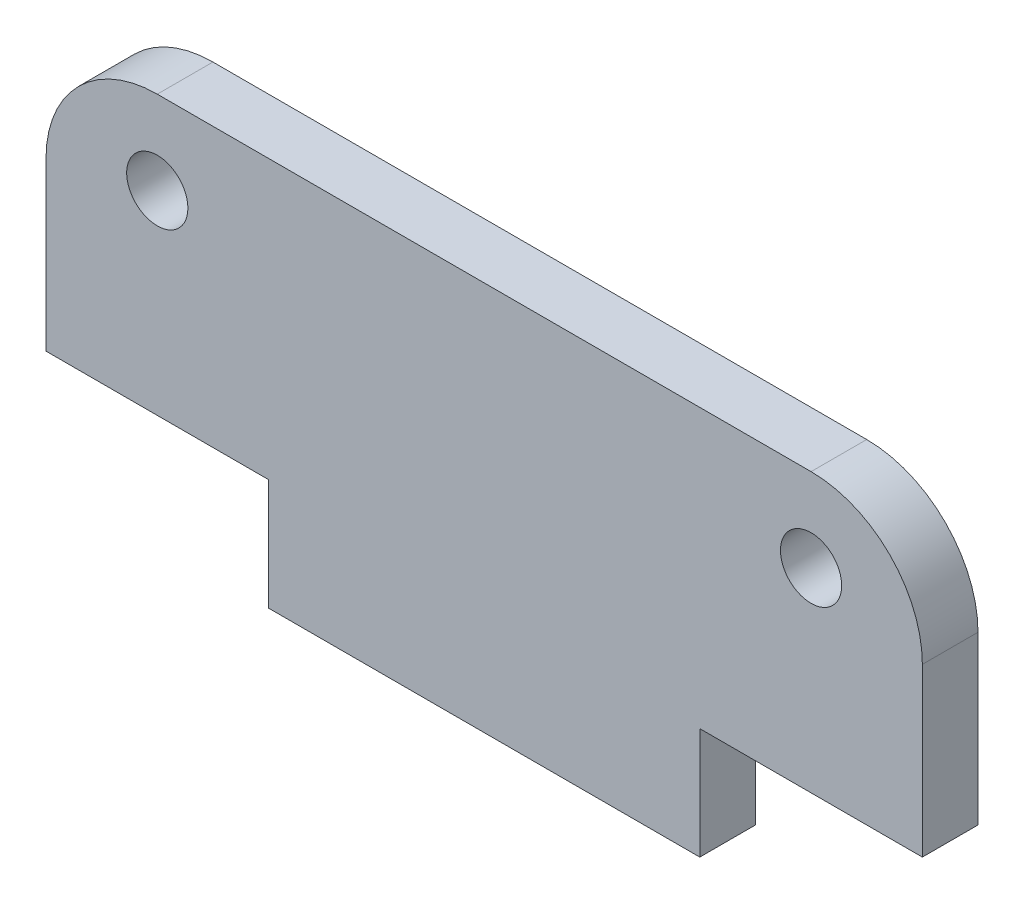
ISO-10303-21;
HEADER;
FILE_DESCRIPTION(('STEP AP214'),'2;1');
FILE_NAME('part.step','',(''),(''),'','','');
FILE_SCHEMA(('AUTOMOTIVE_DESIGN { 1 0 10303 214 1 1 1 1 }'));
ENDSEC;
DATA;
#1=APPLICATION_CONTEXT('core data for automotive mechanical design processes');
#2=APPLICATION_PROTOCOL_DEFINITION('international standard','automotive_design',2000,#1);
#3=PRODUCT_CONTEXT('',#1,'mechanical');
#4=PRODUCT('Part','Part','',(#3));
#5=PRODUCT_RELATED_PRODUCT_CATEGORY('part','',(#4));
#6=PRODUCT_DEFINITION_FORMATION('','',#4);
#7=PRODUCT_DEFINITION_CONTEXT('part definition',#1,'design');
#8=PRODUCT_DEFINITION('design','',#6,#7);
#9=PRODUCT_DEFINITION_SHAPE('','',#8);
#10=(LENGTH_UNIT() NAMED_UNIT(*) SI_UNIT(.MILLI.,.METRE.));
#11=(NAMED_UNIT(*) PLANE_ANGLE_UNIT() SI_UNIT($,.RADIAN.));
#12=(NAMED_UNIT(*) SI_UNIT($,.STERADIAN.) SOLID_ANGLE_UNIT());
#13=UNCERTAINTY_MEASURE_WITH_UNIT(LENGTH_MEASURE(1.E-05),#10,'distance_accuracy_value','');
#14=(GEOMETRIC_REPRESENTATION_CONTEXT(3) GLOBAL_UNCERTAINTY_ASSIGNED_CONTEXT((#13)) GLOBAL_UNIT_ASSIGNED_CONTEXT((#10,
#11,#12)) REPRESENTATION_CONTEXT('',''));
#15=CARTESIAN_POINT('',(0.,0.,0.));
#16=DIRECTION('',(0.,0.,1.));
#17=DIRECTION('',(1.,0.,0.));
#18=AXIS2_PLACEMENT_3D('',#15,#16,#17);
#19=CARTESIAN_POINT('',(11.75,-0.999999999999993,2.));
#20=DIRECTION('',(0.,0.,-1.));
#21=DIRECTION('',(-1.,0.,0.));
#22=AXIS2_PLACEMENT_3D('',#19,#20,#21);
#23=PLANE('',#22);
#24=CARTESIAN_POINT('',(-11.75,0.,2.));
#25=DIRECTION('',(0.,0.,1.));
#26=DIRECTION('',(1.,0.,0.));
#27=AXIS2_PLACEMENT_3D('',#24,#25,#26);
#28=CIRCLE('',#27,1.1);
#29=CARTESIAN_POINT('',(-10.65,0.,2.));
#30=VERTEX_POINT('',#29);
#31=EDGE_CURVE('E145',#30,#30,#28,.T.);
#32=ORIENTED_EDGE('',*,*,#31,.F.);
#33=EDGE_LOOP('',(#32));
#34=FACE_BOUND('',#33,.T.);
#35=CARTESIAN_POINT('',(11.75,-0.999999999999993,2.));
#36=DIRECTION('',(0.,0.,1.));
#37=DIRECTION('',(-1.,0.,0.));
#38=AXIS2_PLACEMENT_3D('',#35,#36,#37);
#39=CIRCLE('',#38,4.);
#40=CARTESIAN_POINT('',(15.75,-0.999999999999994,2.));
#41=VERTEX_POINT('',#40);
#42=CARTESIAN_POINT('',(11.75,3.,2.));
#43=VERTEX_POINT('',#42);
#44=EDGE_CURVE('E160',#41,#43,#39,.T.);
#45=ORIENTED_EDGE('',*,*,#44,.T.);
#46=DIRECTION('',(-1.,0.,0.));
#47=VECTOR('',#46,1.);
#48=CARTESIAN_POINT('',(-11.75,3.,2.));
#49=LINE('',#48,#47);
#50=CARTESIAN_POINT('',(-11.75,3.,2.));
#51=VERTEX_POINT('',#50);
#52=EDGE_CURVE('E98',#43,#51,#49,.T.);
#53=ORIENTED_EDGE('',*,*,#52,.T.);
#54=CARTESIAN_POINT('',(-11.75,-1.,2.));
#55=DIRECTION('',(0.,0.,1.));
#56=DIRECTION('',(1.,0.,0.));
#57=AXIS2_PLACEMENT_3D('',#54,#55,#56);
#58=CIRCLE('',#57,4.);
#59=CARTESIAN_POINT('',(-15.75,-1.,2.));
#60=VERTEX_POINT('',#59);
#61=EDGE_CURVE('E181',#51,#60,#58,.T.);
#62=ORIENTED_EDGE('',*,*,#61,.T.);
#63=DIRECTION('',(0.,-1.,0.));
#64=VECTOR('',#63,1.);
#65=CARTESIAN_POINT('',(-15.75,-1.,2.));
#66=LINE('',#65,#64);
#67=CARTESIAN_POINT('',(-15.75,-7.,2.));
#68=VERTEX_POINT('',#67);
#69=EDGE_CURVE('E200',#60,#68,#66,.T.);
#70=ORIENTED_EDGE('',*,*,#69,.T.);
#71=DIRECTION('',(1.,0.,0.));
#72=VECTOR('',#71,1.);
#73=CARTESIAN_POINT('',(-15.75,-7.,2.));
#74=LINE('',#73,#72);
#75=CARTESIAN_POINT('',(-7.75,-7.,2.));
#76=VERTEX_POINT('',#75);
#77=EDGE_CURVE('E197',#68,#76,#74,.T.);
#78=ORIENTED_EDGE('',*,*,#77,.T.);
#79=DIRECTION('',(0.,-1.,0.));
#80=VECTOR('',#79,1.);
#81=CARTESIAN_POINT('',(-7.75,-11.,2.));
#82=LINE('',#81,#80);
#83=CARTESIAN_POINT('',(-7.75,-11.,2.));
#84=VERTEX_POINT('',#83);
#85=EDGE_CURVE('E199',#76,#84,#82,.T.);
#86=ORIENTED_EDGE('',*,*,#85,.T.);
#87=DIRECTION('',(1.,0.,0.));
#88=VECTOR('',#87,1.);
#89=CARTESIAN_POINT('',(-7.75,-11.,2.));
#90=LINE('',#89,#88);
#91=CARTESIAN_POINT('',(7.75,-11.,2.));
#92=VERTEX_POINT('',#91);
#93=EDGE_CURVE('E123',#84,#92,#90,.T.);
#94=ORIENTED_EDGE('',*,*,#93,.T.);
#95=DIRECTION('',(0.,1.,0.));
#96=VECTOR('',#95,1.);
#97=CARTESIAN_POINT('',(7.75,-11.,2.));
#98=LINE('',#97,#96);
#99=CARTESIAN_POINT('',(7.75,-6.99999999999999,2.));
#100=VERTEX_POINT('',#99);
#101=EDGE_CURVE('E117',#92,#100,#98,.T.);
#102=ORIENTED_EDGE('',*,*,#101,.T.);
#103=DIRECTION('',(1.,0.,0.));
#104=VECTOR('',#103,1.);
#105=CARTESIAN_POINT('',(15.75,-6.99999999999999,2.));
#106=LINE('',#105,#104);
#107=CARTESIAN_POINT('',(15.75,-6.99999999999999,2.));
#108=VERTEX_POINT('',#107);
#109=EDGE_CURVE('E121',#100,#108,#106,.T.);
#110=ORIENTED_EDGE('',*,*,#109,.T.);
#111=DIRECTION('',(0.,1.,0.));
#112=VECTOR('',#111,1.);
#113=CARTESIAN_POINT('',(15.75,-0.999999999999994,2.));
#114=LINE('',#113,#112);
#115=EDGE_CURVE('E49',#108,#41,#114,.T.);
#116=ORIENTED_EDGE('',*,*,#115,.T.);
#117=EDGE_LOOP('',(#45,#53,#62,#70,#78,#86,#94,#102,#110,#116));
#118=FACE_BOUND('',#117,.T.);
#119=CARTESIAN_POINT('',(11.75,0.,2.));
#120=DIRECTION('',(0.,0.,1.));
#121=DIRECTION('',(-1.,0.,0.));
#122=AXIS2_PLACEMENT_3D('',#119,#120,#121);
#123=CIRCLE('',#122,1.1);
#124=CARTESIAN_POINT('',(10.65,0.,2.));
#125=VERTEX_POINT('',#124);
#126=EDGE_CURVE('E211',#125,#125,#123,.T.);
#127=ORIENTED_EDGE('',*,*,#126,.F.);
#128=EDGE_LOOP('',(#127));
#129=FACE_BOUND('',#128,.T.);
#130=ADVANCED_FACE('F32',(#34,#118,#129),#23,.F.);
#131=CARTESIAN_POINT('',(11.75,-0.999999999999993,0.));
#132=DIRECTION('',(0.,0.,-1.));
#133=DIRECTION('',(-1.,0.,0.));
#134=AXIS2_PLACEMENT_3D('',#131,#132,#133);
#135=PLANE('',#134);
#136=CARTESIAN_POINT('',(-11.75,0.,0.));
#137=DIRECTION('',(0.,0.,1.));
#138=DIRECTION('',(1.,0.,0.));
#139=AXIS2_PLACEMENT_3D('',#136,#137,#138);
#140=CIRCLE('',#139,1.1);
#141=CARTESIAN_POINT('',(-10.65,0.,0.));
#142=VERTEX_POINT('',#141);
#143=EDGE_CURVE('E208',#142,#142,#140,.T.);
#144=ORIENTED_EDGE('',*,*,#143,.T.);
#145=EDGE_LOOP('',(#144));
#146=FACE_BOUND('',#145,.T.);
#147=CARTESIAN_POINT('',(11.75,-0.999999999999993,0.));
#148=DIRECTION('',(0.,0.,1.));
#149=DIRECTION('',(-1.,0.,0.));
#150=AXIS2_PLACEMENT_3D('',#147,#148,#149);
#151=CIRCLE('',#150,4.);
#152=CARTESIAN_POINT('',(15.75,-0.999999999999994,0.));
#153=VERTEX_POINT('',#152);
#154=CARTESIAN_POINT('',(11.75,3.,0.));
#155=VERTEX_POINT('',#154);
#156=EDGE_CURVE('E141',#153,#155,#151,.T.);
#157=ORIENTED_EDGE('',*,*,#156,.F.);
#158=DIRECTION('',(0.,1.,0.));
#159=VECTOR('',#158,1.);
#160=CARTESIAN_POINT('',(15.75,-0.999999999999994,0.));
#161=LINE('',#160,#159);
#162=CARTESIAN_POINT('',(15.75,-6.99999999999999,0.));
#163=VERTEX_POINT('',#162);
#164=EDGE_CURVE('E90',#163,#153,#161,.T.);
#165=ORIENTED_EDGE('',*,*,#164,.F.);
#166=DIRECTION('',(1.,0.,0.));
#167=VECTOR('',#166,1.);
#168=CARTESIAN_POINT('',(15.75,-6.99999999999999,0.));
#169=LINE('',#168,#167);
#170=CARTESIAN_POINT('',(7.75,-6.99999999999999,0.));
#171=VERTEX_POINT('',#170);
#172=EDGE_CURVE('E84',#171,#163,#169,.T.);
#173=ORIENTED_EDGE('',*,*,#172,.F.);
#174=DIRECTION('',(0.,1.,0.));
#175=VECTOR('',#174,1.);
#176=CARTESIAN_POINT('',(7.75,-11.,0.));
#177=LINE('',#176,#175);
#178=CARTESIAN_POINT('',(7.75,-11.,0.));
#179=VERTEX_POINT('',#178);
#180=EDGE_CURVE('E131',#179,#171,#177,.T.);
#181=ORIENTED_EDGE('',*,*,#180,.F.);
#182=DIRECTION('',(1.,0.,0.));
#183=VECTOR('',#182,1.);
#184=CARTESIAN_POINT('',(-7.75,-11.,0.));
#185=LINE('',#184,#183);
#186=CARTESIAN_POINT('',(-7.75,-11.,0.));
#187=VERTEX_POINT('',#186);
#188=EDGE_CURVE('E155',#187,#179,#185,.T.);
#189=ORIENTED_EDGE('',*,*,#188,.F.);
#190=DIRECTION('',(0.,-1.,0.));
#191=VECTOR('',#190,1.);
#192=CARTESIAN_POINT('',(-7.75,-11.,0.));
#193=LINE('',#192,#191);
#194=CARTESIAN_POINT('',(-7.75,-7.,0.));
#195=VERTEX_POINT('',#194);
#196=EDGE_CURVE('E153',#195,#187,#193,.T.);
#197=ORIENTED_EDGE('',*,*,#196,.F.);
#198=DIRECTION('',(1.,0.,0.));
#199=VECTOR('',#198,1.);
#200=CARTESIAN_POINT('',(-15.75,-7.,0.));
#201=LINE('',#200,#199);
#202=CARTESIAN_POINT('',(-15.75,-7.,0.));
#203=VERTEX_POINT('',#202);
#204=EDGE_CURVE('E151',#203,#195,#201,.T.);
#205=ORIENTED_EDGE('',*,*,#204,.F.);
#206=DIRECTION('',(0.,-1.,0.));
#207=VECTOR('',#206,1.);
#208=CARTESIAN_POINT('',(-15.75,-1.,0.));
#209=LINE('',#208,#207);
#210=CARTESIAN_POINT('',(-15.75,-1.,0.));
#211=VERTEX_POINT('',#210);
#212=EDGE_CURVE('E149',#211,#203,#209,.T.);
#213=ORIENTED_EDGE('',*,*,#212,.F.);
#214=CARTESIAN_POINT('',(-11.75,-1.,0.));
#215=DIRECTION('',(0.,0.,1.));
#216=DIRECTION('',(1.,0.,0.));
#217=AXIS2_PLACEMENT_3D('',#214,#215,#216);
#218=CIRCLE('',#217,4.);
#219=CARTESIAN_POINT('',(-11.75,3.,0.));
#220=VERTEX_POINT('',#219);
#221=EDGE_CURVE('E147',#220,#211,#218,.T.);
#222=ORIENTED_EDGE('',*,*,#221,.F.);
#223=DIRECTION('',(-1.,0.,0.));
#224=VECTOR('',#223,1.);
#225=CARTESIAN_POINT('',(-11.75,3.,0.));
#226=LINE('',#225,#224);
#227=EDGE_CURVE('E144',#155,#220,#226,.T.);
#228=ORIENTED_EDGE('',*,*,#227,.F.);
#229=EDGE_LOOP('',(#157,#165,#173,#181,#189,#197,#205,#213,#222,#228));
#230=FACE_BOUND('',#229,.T.);
#231=CARTESIAN_POINT('',(11.75,0.,0.));
#232=DIRECTION('',(0.,0.,1.));
#233=DIRECTION('',(-1.,0.,0.));
#234=AXIS2_PLACEMENT_3D('',#231,#232,#233);
#235=CIRCLE('',#234,1.1);
#236=CARTESIAN_POINT('',(10.65,0.,0.));
#237=VERTEX_POINT('',#236);
#238=EDGE_CURVE('E214',#237,#237,#235,.T.);
#239=ORIENTED_EDGE('',*,*,#238,.T.);
#240=EDGE_LOOP('',(#239));
#241=FACE_BOUND('',#240,.T.);
#242=ADVANCED_FACE('F185',(#146,#230,#241),#135,.T.);
#243=CARTESIAN_POINT('',(11.75,-0.999999999999993,2.));
#244=DIRECTION('',(0.,0.,-1.));
#245=DIRECTION('',(-1.,0.,0.));
#246=AXIS2_PLACEMENT_3D('',#243,#244,#245);
#247=CYLINDRICAL_SURFACE('',#246,4.);
#248=ORIENTED_EDGE('',*,*,#156,.T.);
#249=DIRECTION('',(0.,0.,-1.));
#250=VECTOR('',#249,1.);
#251=CARTESIAN_POINT('',(11.75,3.,2.));
#252=LINE('',#251,#250);
#253=EDGE_CURVE('E11',#43,#155,#252,.T.);
#254=ORIENTED_EDGE('',*,*,#253,.F.);
#255=ORIENTED_EDGE('',*,*,#44,.F.);
#256=DIRECTION('',(0.,0.,-1.));
#257=VECTOR('',#256,1.);
#258=CARTESIAN_POINT('',(15.75,-0.999999999999994,2.));
#259=LINE('',#258,#257);
#260=EDGE_CURVE('E137',#41,#153,#259,.T.);
#261=ORIENTED_EDGE('',*,*,#260,.T.);
#262=EDGE_LOOP('',(#248,#254,#255,#261));
#263=FACE_BOUND('',#262,.T.);
#264=ADVANCED_FACE('F34',(#263),#247,.T.);
#265=CARTESIAN_POINT('',(-11.75,3.,2.));
#266=DIRECTION('',(0.,-1.,0.));
#267=DIRECTION('',(1.,0.,0.));
#268=AXIS2_PLACEMENT_3D('',#265,#266,#267);
#269=PLANE('',#268);
#270=ORIENTED_EDGE('',*,*,#227,.T.);
#271=DIRECTION('',(0.,0.,-1.));
#272=VECTOR('',#271,1.);
#273=CARTESIAN_POINT('',(-11.75,3.,2.));
#274=LINE('',#273,#272);
#275=EDGE_CURVE('E41',#51,#220,#274,.T.);
#276=ORIENTED_EDGE('',*,*,#275,.F.);
#277=ORIENTED_EDGE('',*,*,#52,.F.);
#278=ORIENTED_EDGE('',*,*,#253,.T.);
#279=EDGE_LOOP('',(#270,#276,#277,#278));
#280=FACE_BOUND('',#279,.T.);
#281=ADVANCED_FACE('F255',(#280),#269,.F.);
#282=CARTESIAN_POINT('',(-11.75,-1.,2.));
#283=DIRECTION('',(0.,0.,-1.));
#284=DIRECTION('',(-1.,0.,0.));
#285=AXIS2_PLACEMENT_3D('',#282,#283,#284);
#286=CYLINDRICAL_SURFACE('',#285,4.);
#287=ORIENTED_EDGE('',*,*,#221,.T.);
#288=DIRECTION('',(0.,0.,-1.));
#289=VECTOR('',#288,1.);
#290=CARTESIAN_POINT('',(-15.75,-1.,2.));
#291=LINE('',#290,#289);
#292=EDGE_CURVE('E173',#60,#211,#291,.T.);
#293=ORIENTED_EDGE('',*,*,#292,.F.);
#294=ORIENTED_EDGE('',*,*,#61,.F.);
#295=ORIENTED_EDGE('',*,*,#275,.T.);
#296=EDGE_LOOP('',(#287,#293,#294,#295));
#297=FACE_BOUND('',#296,.T.);
#298=ADVANCED_FACE('F179',(#297),#286,.T.);
#299=CARTESIAN_POINT('',(-15.75,-1.,2.));
#300=DIRECTION('',(1.,0.,0.));
#301=DIRECTION('',(0.,0.,-1.));
#302=AXIS2_PLACEMENT_3D('',#299,#300,#301);
#303=PLANE('',#302);
#304=ORIENTED_EDGE('',*,*,#212,.T.);
#305=DIRECTION('',(0.,0.,-1.));
#306=VECTOR('',#305,1.);
#307=CARTESIAN_POINT('',(-15.75,-7.,2.));
#308=LINE('',#307,#306);
#309=EDGE_CURVE('E170',#68,#203,#308,.T.);
#310=ORIENTED_EDGE('',*,*,#309,.F.);
#311=ORIENTED_EDGE('',*,*,#69,.F.);
#312=ORIENTED_EDGE('',*,*,#292,.T.);
#313=EDGE_LOOP('',(#304,#310,#311,#312));
#314=FACE_BOUND('',#313,.T.);
#315=ADVANCED_FACE('F191',(#314),#303,.F.);
#316=CARTESIAN_POINT('',(-15.75,-7.,2.));
#317=DIRECTION('',(0.,1.,0.));
#318=DIRECTION('',(0.,0.,1.));
#319=AXIS2_PLACEMENT_3D('',#316,#317,#318);
#320=PLANE('',#319);
#321=ORIENTED_EDGE('',*,*,#204,.T.);
#322=DIRECTION('',(0.,0.,-1.));
#323=VECTOR('',#322,1.);
#324=CARTESIAN_POINT('',(-7.75,-7.,2.));
#325=LINE('',#324,#323);
#326=EDGE_CURVE('E167',#76,#195,#325,.T.);
#327=ORIENTED_EDGE('',*,*,#326,.F.);
#328=ORIENTED_EDGE('',*,*,#77,.F.);
#329=ORIENTED_EDGE('',*,*,#309,.T.);
#330=EDGE_LOOP('',(#321,#327,#328,#329));
#331=FACE_BOUND('',#330,.T.);
#332=ADVANCED_FACE('F195',(#331),#320,.F.);
#333=CARTESIAN_POINT('',(-7.75,-11.,2.));
#334=DIRECTION('',(1.,0.,0.));
#335=DIRECTION('',(0.,0.,-1.));
#336=AXIS2_PLACEMENT_3D('',#333,#334,#335);
#337=PLANE('',#336);
#338=ORIENTED_EDGE('',*,*,#196,.T.);
#339=DIRECTION('',(0.,0.,-1.));
#340=VECTOR('',#339,1.);
#341=CARTESIAN_POINT('',(-7.75,-11.,2.));
#342=LINE('',#341,#340);
#343=EDGE_CURVE('E164',#84,#187,#342,.T.);
#344=ORIENTED_EDGE('',*,*,#343,.F.);
#345=ORIENTED_EDGE('',*,*,#85,.F.);
#346=ORIENTED_EDGE('',*,*,#326,.T.);
#347=EDGE_LOOP('',(#338,#344,#345,#346));
#348=FACE_BOUND('',#347,.T.);
#349=ADVANCED_FACE('F245',(#348),#337,.F.);
#350=CARTESIAN_POINT('',(-7.75,-11.,2.));
#351=DIRECTION('',(0.,1.,0.));
#352=DIRECTION('',(-1.,0.,0.));
#353=AXIS2_PLACEMENT_3D('',#350,#351,#352);
#354=PLANE('',#353);
#355=ORIENTED_EDGE('',*,*,#188,.T.);
#356=DIRECTION('',(0.,0.,-1.));
#357=VECTOR('',#356,1.);
#358=CARTESIAN_POINT('',(7.75,-11.,2.));
#359=LINE('',#358,#357);
#360=EDGE_CURVE('E132',#92,#179,#359,.T.);
#361=ORIENTED_EDGE('',*,*,#360,.F.);
#362=ORIENTED_EDGE('',*,*,#93,.F.);
#363=ORIENTED_EDGE('',*,*,#343,.T.);
#364=EDGE_LOOP('',(#355,#361,#362,#363));
#365=FACE_BOUND('',#364,.T.);
#366=ADVANCED_FACE('F242',(#365),#354,.F.);
#367=CARTESIAN_POINT('',(7.75,-11.,2.));
#368=DIRECTION('',(-1.,0.,0.));
#369=DIRECTION('',(0.,-1.,0.));
#370=AXIS2_PLACEMENT_3D('',#367,#368,#369);
#371=PLANE('',#370);
#372=ORIENTED_EDGE('',*,*,#180,.T.);
#373=DIRECTION('',(0.,0.,-1.));
#374=VECTOR('',#373,1.);
#375=CARTESIAN_POINT('',(7.75,-6.99999999999999,2.));
#376=LINE('',#375,#374);
#377=EDGE_CURVE('E128',#100,#171,#376,.T.);
#378=ORIENTED_EDGE('',*,*,#377,.F.);
#379=ORIENTED_EDGE('',*,*,#101,.F.);
#380=ORIENTED_EDGE('',*,*,#360,.T.);
#381=EDGE_LOOP('',(#372,#378,#379,#380));
#382=FACE_BOUND('',#381,.T.);
#383=ADVANCED_FACE('F129',(#382),#371,.F.);
#384=CARTESIAN_POINT('',(15.75,-6.99999999999999,2.));
#385=DIRECTION('',(0.,1.,0.));
#386=DIRECTION('',(0.,0.,1.));
#387=AXIS2_PLACEMENT_3D('',#384,#385,#386);
#388=PLANE('',#387);
#389=ORIENTED_EDGE('',*,*,#172,.T.);
#390=DIRECTION('',(0.,0.,-1.));
#391=VECTOR('',#390,1.);
#392=CARTESIAN_POINT('',(15.75,-6.99999999999999,2.));
#393=LINE('',#392,#391);
#394=EDGE_CURVE('E133',#108,#163,#393,.T.);
#395=ORIENTED_EDGE('',*,*,#394,.F.);
#396=ORIENTED_EDGE('',*,*,#109,.F.);
#397=ORIENTED_EDGE('',*,*,#377,.T.);
#398=EDGE_LOOP('',(#389,#395,#396,#397));
#399=FACE_BOUND('',#398,.T.);
#400=ADVANCED_FACE('F135',(#399),#388,.F.);
#401=CARTESIAN_POINT('',(15.75,-0.999999999999994,2.));
#402=DIRECTION('',(-1.,0.,0.));
#403=DIRECTION('',(0.,0.,1.));
#404=AXIS2_PLACEMENT_3D('',#401,#402,#403);
#405=PLANE('',#404);
#406=ORIENTED_EDGE('',*,*,#164,.T.);
#407=ORIENTED_EDGE('',*,*,#260,.F.);
#408=ORIENTED_EDGE('',*,*,#115,.F.);
#409=ORIENTED_EDGE('',*,*,#394,.T.);
#410=EDGE_LOOP('',(#406,#407,#408,#409));
#411=FACE_BOUND('',#410,.T.);
#412=ADVANCED_FACE('F235',(#411),#405,.F.);
#413=CARTESIAN_POINT('',(-11.75,0.,2.));
#414=DIRECTION('',(0.,0.,-1.));
#415=DIRECTION('',(-1.,0.,0.));
#416=AXIS2_PLACEMENT_3D('',#413,#414,#415);
#417=CYLINDRICAL_SURFACE('',#416,1.1);
#418=ORIENTED_EDGE('',*,*,#31,.T.);
#419=EDGE_LOOP('',(#418));
#420=FACE_BOUND('',#419,.T.);
#421=ORIENTED_EDGE('',*,*,#143,.F.);
#422=EDGE_LOOP('',(#421));
#423=FACE_BOUND('',#422,.T.);
#424=ADVANCED_FACE('F232',(#420,#423),#417,.F.);
#425=CARTESIAN_POINT('',(11.75,0.,2.));
#426=DIRECTION('',(0.,0.,-1.));
#427=DIRECTION('',(-1.,0.,0.));
#428=AXIS2_PLACEMENT_3D('',#425,#426,#427);
#429=CYLINDRICAL_SURFACE('',#428,1.1);
#430=ORIENTED_EDGE('',*,*,#126,.T.);
#431=EDGE_LOOP('',(#430));
#432=FACE_BOUND('',#431,.T.);
#433=ORIENTED_EDGE('',*,*,#238,.F.);
#434=EDGE_LOOP('',(#433));
#435=FACE_BOUND('',#434,.T.);
#436=ADVANCED_FACE('F220',(#432,#435),#429,.F.);
#437=CLOSED_SHELL('',(#130,#242,#264,#281,#298,#315,#332,#349,#366,#383,#400,#412,#424,#436));
#438=MANIFOLD_SOLID_BREP('B2',#437);
#439=ADVANCED_BREP_SHAPE_REPRESENTATION('',(#18,#438),#14);
#440=SHAPE_DEFINITION_REPRESENTATION(#9,#439);
ENDSEC;
END-ISO-10303-21;
